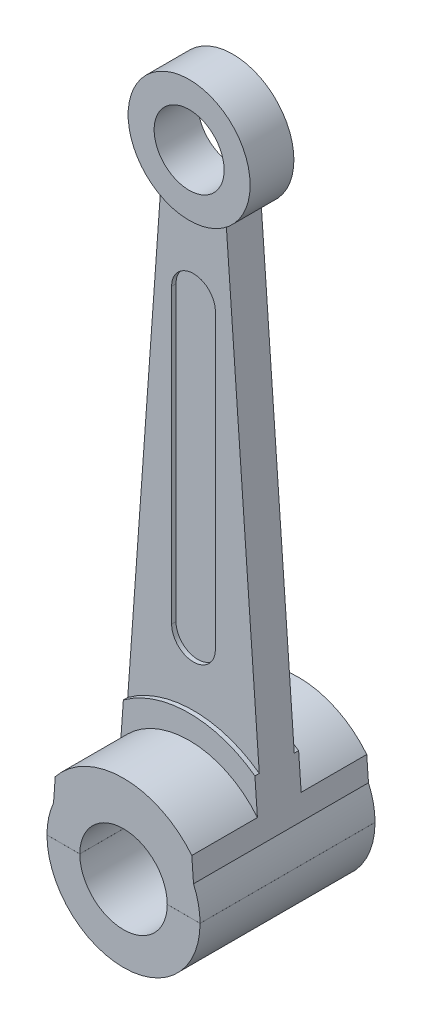
ISO-10303-21;
HEADER;
FILE_DESCRIPTION(('STEP AP214'),'2;1');
FILE_NAME('part.step','',(''),(''),'','','');
FILE_SCHEMA(('AUTOMOTIVE_DESIGN { 1 0 10303 214 1 1 1 1 }'));
ENDSEC;
DATA;
#1=APPLICATION_CONTEXT('core data for automotive mechanical design processes');
#2=APPLICATION_PROTOCOL_DEFINITION('international standard','automotive_design',2000,#1);
#3=PRODUCT_CONTEXT('',#1,'mechanical');
#4=PRODUCT('Part','Part','',(#3));
#5=PRODUCT_RELATED_PRODUCT_CATEGORY('part','',(#4));
#6=PRODUCT_DEFINITION_FORMATION('','',#4);
#7=PRODUCT_DEFINITION_CONTEXT('part definition',#1,'design');
#8=PRODUCT_DEFINITION('design','',#6,#7);
#9=PRODUCT_DEFINITION_SHAPE('','',#8);
#10=(LENGTH_UNIT() NAMED_UNIT(*) SI_UNIT(.MILLI.,.METRE.));
#11=(NAMED_UNIT(*) PLANE_ANGLE_UNIT() SI_UNIT($,.RADIAN.));
#12=(NAMED_UNIT(*) SI_UNIT($,.STERADIAN.) SOLID_ANGLE_UNIT());
#13=UNCERTAINTY_MEASURE_WITH_UNIT(LENGTH_MEASURE(1.E-05),#10,'distance_accuracy_value','');
#14=(GEOMETRIC_REPRESENTATION_CONTEXT(3) GLOBAL_UNCERTAINTY_ASSIGNED_CONTEXT((#13)) GLOBAL_UNIT_ASSIGNED_CONTEXT((#10,
#11,#12)) REPRESENTATION_CONTEXT('',''));
#15=CARTESIAN_POINT('',(0.,0.,0.));
#16=DIRECTION('',(0.,0.,1.));
#17=DIRECTION('',(1.,0.,0.));
#18=AXIS2_PLACEMENT_3D('',#15,#16,#17);
#19=CARTESIAN_POINT('',(0.,0.,-20.75));
#20=DIRECTION('',(0.,0.,1.));
#21=DIRECTION('',(1.,0.,0.));
#22=AXIS2_PLACEMENT_3D('',#19,#20,#21);
#23=CYLINDRICAL_SURFACE('',#22,1.75);
#24=CARTESIAN_POINT('',(0.,0.,-2.));
#25=DIRECTION('',(0.,0.,1.));
#26=DIRECTION('',(1.,0.,0.));
#27=AXIS2_PLACEMENT_3D('',#24,#25,#26);
#28=CIRCLE('',#27,1.75);
#29=CARTESIAN_POINT('',(-1.74999971428569,0.000999999999999505,-2.));
#30=VERTEX_POINT('',#29);
#31=CARTESIAN_POINT('',(-1.6,0.708872343937891,-2.));
#32=VERTEX_POINT('',#31);
#33=EDGE_CURVE('E262',#30,#32,#28,.F.);
#34=ORIENTED_EDGE('',*,*,#33,.F.);
#35=DIRECTION('',(0.,0.,1.));
#36=VECTOR('',#35,1.);
#37=CARTESIAN_POINT('',(-1.74999971428569,0.000999999999999505,-20.75));
#38=LINE('',#37,#36);
#39=CARTESIAN_POINT('',(-1.74999971428569,0.000999999999999505,2.));
#40=VERTEX_POINT('',#39);
#41=EDGE_CURVE('E327',#30,#40,#38,.T.);
#42=ORIENTED_EDGE('',*,*,#41,.T.);
#43=CARTESIAN_POINT('',(0.,0.,2.));
#44=DIRECTION('',(0.,0.,1.));
#45=DIRECTION('',(1.,0.,0.));
#46=AXIS2_PLACEMENT_3D('',#43,#44,#45);
#47=CIRCLE('',#46,1.75);
#48=CARTESIAN_POINT('',(-1.6,0.708872343937891,2.));
#49=VERTEX_POINT('',#48);
#50=EDGE_CURVE('E201',#40,#49,#47,.F.);
#51=ORIENTED_EDGE('',*,*,#50,.T.);
#52=DIRECTION('',(0.,0.,1.));
#53=VECTOR('',#52,1.);
#54=CARTESIAN_POINT('',(-1.6,0.708872343937891,-20.75));
#55=LINE('',#54,#53);
#56=EDGE_CURVE('E257',#32,#49,#55,.T.);
#57=ORIENTED_EDGE('',*,*,#56,.F.);
#58=EDGE_LOOP('',(#34,#42,#51,#57));
#59=FACE_BOUND('',#58,.T.);
#60=ADVANCED_FACE('F59',(#59),#23,.T.);
#61=CARTESIAN_POINT('',(0.,0.,0.5));
#62=DIRECTION('',(0.,0.,-1.));
#63=DIRECTION('',(-1.,0.,0.));
#64=AXIS2_PLACEMENT_3D('',#61,#62,#63);
#65=CYLINDRICAL_SURFACE('',#64,2.54);
#66=CARTESIAN_POINT('',(0.,0.,-0.5));
#67=DIRECTION('',(0.,0.,1.));
#68=DIRECTION('',(1.,0.,0.));
#69=AXIS2_PLACEMENT_3D('',#66,#67,#68);
#70=CIRCLE('',#69,2.54);
#71=CARTESIAN_POINT('',(1.5036414370813,2.04711075144753,-0.5));
#72=VERTEX_POINT('',#71);
#73=CARTESIAN_POINT('',(-1.5036414370813,2.04711075144753,-0.5));
#74=VERTEX_POINT('',#73);
#75=EDGE_CURVE('E197',#72,#74,#70,.T.);
#76=ORIENTED_EDGE('',*,*,#75,.T.);
#77=DIRECTION('',(0.,0.,-1.));
#78=VECTOR('',#77,1.);
#79=CARTESIAN_POINT('',(-1.5036414370813,2.04711075144753,0.5));
#80=LINE('',#79,#78);
#81=CARTESIAN_POINT('',(-1.5036414370813,2.04711075144753,-0.4));
#82=VERTEX_POINT('',#81);
#83=EDGE_CURVE('E200',#74,#82,#80,.F.);
#84=ORIENTED_EDGE('',*,*,#83,.T.);
#85=CARTESIAN_POINT('',(0.,0.,-0.4));
#86=DIRECTION('',(0.,0.,1.));
#87=DIRECTION('',(1.,0.,0.));
#88=AXIS2_PLACEMENT_3D('',#85,#86,#87);
#89=CIRCLE('',#88,2.54);
#90=CARTESIAN_POINT('',(1.5036414370813,2.04711075144753,-0.4));
#91=VERTEX_POINT('',#90);
#92=EDGE_CURVE('E250',#91,#82,#89,.T.);
#93=ORIENTED_EDGE('',*,*,#92,.F.);
#94=DIRECTION('',(0.,0.,-1.));
#95=VECTOR('',#94,1.);
#96=CARTESIAN_POINT('',(1.5036414370813,2.04711075144753,0.5));
#97=LINE('',#96,#95);
#98=EDGE_CURVE('E113',#91,#72,#97,.T.);
#99=ORIENTED_EDGE('',*,*,#98,.T.);
#100=EDGE_LOOP('',(#76,#84,#93,#99));
#101=FACE_BOUND('',#100,.T.);
#102=ADVANCED_FACE('F444',(#101),#65,.T.);
#103=CARTESIAN_POINT('',(0.,10.69,0.4));
#104=DIRECTION('',(0.,0.,-1.));
#105=DIRECTION('',(-1.,0.,0.));
#106=AXIS2_PLACEMENT_3D('',#103,#104,#105);
#107=CYLINDRICAL_SURFACE('',#106,0.5);
#108=DIRECTION('',(0.,0.,-1.));
#109=VECTOR('',#108,1.);
#110=CARTESIAN_POINT('',(0.5,10.69,0.4));
#111=LINE('',#110,#109);
#112=CARTESIAN_POINT('',(0.5,10.69,-0.3));
#113=VERTEX_POINT('',#112);
#114=CARTESIAN_POINT('',(0.5,10.69,-0.4));
#115=VERTEX_POINT('',#114);
#116=EDGE_CURVE('E219',#113,#115,#111,.T.);
#117=ORIENTED_EDGE('',*,*,#116,.F.);
#118=CARTESIAN_POINT('',(0.,10.69,-0.3));
#119=DIRECTION('',(0.,0.,1.));
#120=DIRECTION('',(1.,0.,0.));
#121=AXIS2_PLACEMENT_3D('',#118,#119,#120);
#122=CIRCLE('',#121,0.5);
#123=CARTESIAN_POINT('',(-0.500000000000001,10.69,-0.3));
#124=VERTEX_POINT('',#123);
#125=EDGE_CURVE('E212',#113,#124,#122,.T.);
#126=ORIENTED_EDGE('',*,*,#125,.T.);
#127=DIRECTION('',(0.,0.,-1.));
#128=VECTOR('',#127,1.);
#129=CARTESIAN_POINT('',(-0.500000000000001,10.69,0.4));
#130=LINE('',#129,#128);
#131=CARTESIAN_POINT('',(-0.500000000000001,10.69,-0.4));
#132=VERTEX_POINT('',#131);
#133=EDGE_CURVE('E215',#124,#132,#130,.T.);
#134=ORIENTED_EDGE('',*,*,#133,.T.);
#135=CARTESIAN_POINT('',(0.,10.69,-0.4));
#136=DIRECTION('',(0.,0.,1.));
#137=DIRECTION('',(1.,0.,0.));
#138=AXIS2_PLACEMENT_3D('',#135,#136,#137);
#139=CIRCLE('',#138,0.5);
#140=EDGE_CURVE('E182',#115,#132,#139,.T.);
#141=ORIENTED_EDGE('',*,*,#140,.F.);
#142=EDGE_LOOP('',(#117,#126,#134,#141));
#143=FACE_BOUND('',#142,.T.);
#144=ADVANCED_FACE('F390',(#143),#107,.F.);
#145=CARTESIAN_POINT('',(0.500000000000003,0.,0.4));
#146=DIRECTION('',(-1.,0.,0.));
#147=DIRECTION('',(0.,-1.,0.));
#148=AXIS2_PLACEMENT_3D('',#145,#146,#147);
#149=PLANE('',#148);
#150=DIRECTION('',(0.,0.,-1.));
#151=VECTOR('',#150,1.);
#152=CARTESIAN_POINT('',(0.500000000000001,4.,0.4));
#153=LINE('',#152,#151);
#154=CARTESIAN_POINT('',(0.500000000000001,4.,-0.3));
#155=VERTEX_POINT('',#154);
#156=CARTESIAN_POINT('',(0.500000000000001,4.,-0.4));
#157=VERTEX_POINT('',#156);
#158=EDGE_CURVE('E223',#155,#157,#153,.T.);
#159=ORIENTED_EDGE('',*,*,#158,.F.);
#160=DIRECTION('',(0.,1.,0.));
#161=VECTOR('',#160,1.);
#162=CARTESIAN_POINT('',(0.500000000000001,4.,-0.3));
#163=LINE('',#162,#161);
#164=EDGE_CURVE('E216',#155,#113,#163,.T.);
#165=ORIENTED_EDGE('',*,*,#164,.T.);
#166=ORIENTED_EDGE('',*,*,#116,.T.);
#167=DIRECTION('',(0.,1.,0.));
#168=VECTOR('',#167,1.);
#169=CARTESIAN_POINT('',(0.500000000000003,0.,-0.4));
#170=LINE('',#169,#168);
#171=EDGE_CURVE('E367',#157,#115,#170,.T.);
#172=ORIENTED_EDGE('',*,*,#171,.F.);
#173=EDGE_LOOP('',(#159,#165,#166,#172));
#174=FACE_BOUND('',#173,.T.);
#175=ADVANCED_FACE('F514',(#174),#149,.T.);
#176=CARTESIAN_POINT('',(0.,4.,0.4));
#177=DIRECTION('',(0.,0.,-1.));
#178=DIRECTION('',(-1.,0.,0.));
#179=AXIS2_PLACEMENT_3D('',#176,#177,#178);
#180=CYLINDRICAL_SURFACE('',#179,0.5);
#181=DIRECTION('',(0.,0.,-1.));
#182=VECTOR('',#181,1.);
#183=CARTESIAN_POINT('',(-0.499999999999999,4.,0.4));
#184=LINE('',#183,#182);
#185=CARTESIAN_POINT('',(-0.499999999999999,4.,-0.3));
#186=VERTEX_POINT('',#185);
#187=CARTESIAN_POINT('',(-0.499999999999999,4.,-0.4));
#188=VERTEX_POINT('',#187);
#189=EDGE_CURVE('E361',#186,#188,#184,.T.);
#190=ORIENTED_EDGE('',*,*,#189,.F.);
#191=CARTESIAN_POINT('',(0.,4.,-0.3));
#192=DIRECTION('',(0.,0.,1.));
#193=DIRECTION('',(1.,0.,0.));
#194=AXIS2_PLACEMENT_3D('',#191,#192,#193);
#195=CIRCLE('',#194,0.5);
#196=EDGE_CURVE('E220',#186,#155,#195,.T.);
#197=ORIENTED_EDGE('',*,*,#196,.T.);
#198=ORIENTED_EDGE('',*,*,#158,.T.);
#199=CARTESIAN_POINT('',(0.,4.,-0.4));
#200=DIRECTION('',(0.,0.,1.));
#201=DIRECTION('',(1.,0.,0.));
#202=AXIS2_PLACEMENT_3D('',#199,#200,#201);
#203=CIRCLE('',#202,0.5);
#204=EDGE_CURVE('E371',#188,#157,#203,.T.);
#205=ORIENTED_EDGE('',*,*,#204,.F.);
#206=EDGE_LOOP('',(#190,#197,#198,#205));
#207=FACE_BOUND('',#206,.T.);
#208=ADVANCED_FACE('F512',(#207),#180,.F.);
#209=CARTESIAN_POINT('',(-0.499999999999998,0.,0.4));
#210=DIRECTION('',(-1.,0.,0.));
#211=DIRECTION('',(0.,-1.,0.));
#212=AXIS2_PLACEMENT_3D('',#209,#210,#211);
#213=PLANE('',#212);
#214=DIRECTION('',(0.,1.,0.));
#215=VECTOR('',#214,1.);
#216=CARTESIAN_POINT('',(-0.499999999999999,4.,-0.3));
#217=LINE('',#216,#215);
#218=EDGE_CURVE('E207',#186,#124,#217,.T.);
#219=ORIENTED_EDGE('',*,*,#218,.F.);
#220=ORIENTED_EDGE('',*,*,#189,.T.);
#221=DIRECTION('',(0.,1.,0.));
#222=VECTOR('',#221,1.);
#223=CARTESIAN_POINT('',(-0.499999999999998,0.,-0.4));
#224=LINE('',#223,#222);
#225=EDGE_CURVE('E174',#188,#132,#224,.T.);
#226=ORIENTED_EDGE('',*,*,#225,.T.);
#227=ORIENTED_EDGE('',*,*,#133,.F.);
#228=EDGE_LOOP('',(#219,#220,#226,#227));
#229=FACE_BOUND('',#228,.T.);
#230=ADVANCED_FACE('F507',(#229),#213,.F.);
#231=CARTESIAN_POINT('',(0.,13.69,0.5));
#232=DIRECTION('',(0.,0.,-1.));
#233=DIRECTION('',(-1.,0.,0.));
#234=AXIS2_PLACEMENT_3D('',#231,#232,#233);
#235=CYLINDRICAL_SURFACE('',#234,0.8);
#236=CARTESIAN_POINT('',(0.,13.69,0.5));
#237=DIRECTION('',(0.,0.,1.));
#238=DIRECTION('',(1.,0.,0.));
#239=AXIS2_PLACEMENT_3D('',#236,#237,#238);
#240=CIRCLE('',#239,0.8);
#241=CARTESIAN_POINT('',(0.799999999999999,13.69,0.5));
#242=VERTEX_POINT('',#241);
#243=EDGE_CURVE('E171',#242,#242,#240,.T.);
#244=ORIENTED_EDGE('',*,*,#243,.T.);
#245=EDGE_LOOP('',(#244));
#246=FACE_BOUND('',#245,.T.);
#247=CARTESIAN_POINT('',(0.,13.69,-0.5));
#248=DIRECTION('',(0.,0.,1.));
#249=DIRECTION('',(1.,0.,0.));
#250=AXIS2_PLACEMENT_3D('',#247,#248,#249);
#251=CIRCLE('',#250,0.8);
#252=CARTESIAN_POINT('',(0.799999999999999,13.69,-0.5));
#253=VERTEX_POINT('',#252);
#254=EDGE_CURVE('E196',#253,#253,#251,.T.);
#255=ORIENTED_EDGE('',*,*,#254,.F.);
#256=EDGE_LOOP('',(#255));
#257=FACE_BOUND('',#256,.T.);
#258=ADVANCED_FACE('F553',(#246,#257),#235,.F.);
#259=CARTESIAN_POINT('',(0.,13.69,0.5));
#260=DIRECTION('',(0.,0.,-1.));
#261=DIRECTION('',(-1.,0.,0.));
#262=AXIS2_PLACEMENT_3D('',#259,#260,#261);
#263=CYLINDRICAL_SURFACE('',#262,1.395);
#264=DIRECTION('',(0.,0.,-1.));
#265=VECTOR('',#264,1.);
#266=CARTESIAN_POINT('',(-0.75,12.5137666047931,0.4));
#267=LINE('',#266,#265);
#268=CARTESIAN_POINT('',(-0.75,12.5137666047931,0.400000000000001));
#269=VERTEX_POINT('',#268);
#270=CARTESIAN_POINT('',(-0.75,12.5137666047931,-0.400000000000001));
#271=VERTEX_POINT('',#270);
#272=EDGE_CURVE('E170',#269,#271,#267,.T.);
#273=ORIENTED_EDGE('',*,*,#272,.F.);
#274=CARTESIAN_POINT('',(0.,13.69,0.4));
#275=DIRECTION('',(0.,0.,1.));
#276=DIRECTION('',(1.,0.,0.));
#277=AXIS2_PLACEMENT_3D('',#274,#275,#276);
#278=CIRCLE('',#277,1.395);
#279=CARTESIAN_POINT('',(0.75,12.5137666047931,0.400000000000001));
#280=VERTEX_POINT('',#279);
#281=EDGE_CURVE('E152',#269,#280,#278,.T.);
#282=ORIENTED_EDGE('',*,*,#281,.T.);
#283=DIRECTION('',(0.,0.,-1.));
#284=VECTOR('',#283,1.);
#285=CARTESIAN_POINT('',(0.75,12.5137666047931,0.4));
#286=LINE('',#285,#284);
#287=CARTESIAN_POINT('',(0.75,12.5137666047931,-0.400000000000001));
#288=VERTEX_POINT('',#287);
#289=EDGE_CURVE('E142',#280,#288,#286,.T.);
#290=ORIENTED_EDGE('',*,*,#289,.T.);
#291=CARTESIAN_POINT('',(0.,13.69,-0.4));
#292=DIRECTION('',(0.,0.,1.));
#293=DIRECTION('',(1.,0.,0.));
#294=AXIS2_PLACEMENT_3D('',#291,#292,#293);
#295=CIRCLE('',#294,1.395);
#296=EDGE_CURVE('E249',#271,#288,#295,.T.);
#297=ORIENTED_EDGE('',*,*,#296,.F.);
#298=EDGE_LOOP('',(#273,#282,#290,#297));
#299=FACE_BOUND('',#298,.T.);
#300=CARTESIAN_POINT('',(0.,13.69,-0.5));
#301=DIRECTION('',(0.,0.,1.));
#302=DIRECTION('',(1.,0.,0.));
#303=AXIS2_PLACEMENT_3D('',#300,#301,#302);
#304=CIRCLE('',#303,1.395);
#305=CARTESIAN_POINT('',(1.395,13.69,-0.5));
#306=VERTEX_POINT('',#305);
#307=EDGE_CURVE('E151',#306,#306,#304,.T.);
#308=ORIENTED_EDGE('',*,*,#307,.T.);
#309=EDGE_LOOP('',(#308));
#310=FACE_BOUND('',#309,.T.);
#311=CARTESIAN_POINT('',(0.,13.69,0.5));
#312=DIRECTION('',(0.,0.,1.));
#313=DIRECTION('',(1.,0.,0.));
#314=AXIS2_PLACEMENT_3D('',#311,#312,#313);
#315=CIRCLE('',#314,1.395);
#316=CARTESIAN_POINT('',(1.395,13.69,0.5));
#317=VERTEX_POINT('',#316);
#318=EDGE_CURVE('E350',#317,#317,#315,.T.);
#319=ORIENTED_EDGE('',*,*,#318,.F.);
#320=EDGE_LOOP('',(#319));
#321=FACE_BOUND('',#320,.T.);
#322=ADVANCED_FACE('F167',(#299,#310,#321),#263,.T.);
#323=CARTESIAN_POINT('',(0.,0.,0.5));
#324=DIRECTION('',(0.,0.,1.));
#325=DIRECTION('',(1.,0.,0.));
#326=AXIS2_PLACEMENT_3D('',#323,#324,#325);
#327=PLANE('',#326);
#328=ORIENTED_EDGE('',*,*,#243,.F.);
#329=EDGE_LOOP('',(#328));
#330=FACE_BOUND('',#329,.T.);
#331=ORIENTED_EDGE('',*,*,#318,.T.);
#332=EDGE_LOOP('',(#331));
#333=FACE_BOUND('',#332,.T.);
#334=ADVANCED_FACE('F562',(#330,#333),#327,.T.);
#335=CARTESIAN_POINT('',(0.,0.,-0.5));
#336=DIRECTION('',(0.,0.,1.));
#337=DIRECTION('',(1.,0.,0.));
#338=AXIS2_PLACEMENT_3D('',#335,#336,#337);
#339=PLANE('',#338);
#340=ORIENTED_EDGE('',*,*,#254,.T.);
#341=EDGE_LOOP('',(#340));
#342=FACE_BOUND('',#341,.T.);
#343=ORIENTED_EDGE('',*,*,#307,.F.);
#344=EDGE_LOOP('',(#343));
#345=FACE_BOUND('',#344,.T.);
#346=ADVANCED_FACE('F534',(#342,#345),#339,.F.);
#347=CARTESIAN_POINT('',(0.,10.69,0.3));
#348=DIRECTION('',(0.,0.,1.));
#349=DIRECTION('',(1.,0.,0.));
#350=AXIS2_PLACEMENT_3D('',#347,#348,#349);
#351=CIRCLE('',#350,0.5);
#352=CARTESIAN_POINT('',(0.5,10.69,0.3));
#353=VERTEX_POINT('',#352);
#354=CARTESIAN_POINT('',(-0.500000000000001,10.69,0.3));
#355=VERTEX_POINT('',#354);
#356=EDGE_CURVE('E227',#353,#355,#351,.T.);
#357=ORIENTED_EDGE('',*,*,#356,.F.);
#358=CARTESIAN_POINT('',(0.5,10.69,0.4));
#359=VERTEX_POINT('',#358);
#360=EDGE_CURVE('E188',#359,#353,#111,.T.);
#361=ORIENTED_EDGE('',*,*,#360,.F.);
#362=CARTESIAN_POINT('',(0.,10.69,0.4));
#363=DIRECTION('',(0.,0.,1.));
#364=DIRECTION('',(1.,0.,0.));
#365=AXIS2_PLACEMENT_3D('',#362,#363,#364);
#366=CIRCLE('',#365,0.5);
#367=CARTESIAN_POINT('',(-0.500000000000001,10.69,0.4));
#368=VERTEX_POINT('',#367);
#369=EDGE_CURVE('E193',#359,#368,#366,.T.);
#370=ORIENTED_EDGE('',*,*,#369,.T.);
#371=EDGE_CURVE('E192',#368,#355,#130,.T.);
#372=ORIENTED_EDGE('',*,*,#371,.T.);
#373=EDGE_LOOP('',(#357,#361,#370,#372));
#374=FACE_BOUND('',#373,.T.);
#375=ADVANCED_FACE('F525',(#374),#107,.F.);
#376=DIRECTION('',(0.,1.,0.));
#377=VECTOR('',#376,1.);
#378=CARTESIAN_POINT('',(0.500000000000001,4.,0.3));
#379=LINE('',#378,#377);
#380=CARTESIAN_POINT('',(0.500000000000001,4.,0.3));
#381=VERTEX_POINT('',#380);
#382=EDGE_CURVE('E231',#381,#353,#379,.T.);
#383=ORIENTED_EDGE('',*,*,#382,.F.);
#384=CARTESIAN_POINT('',(0.500000000000001,4.,0.4));
#385=VERTEX_POINT('',#384);
#386=EDGE_CURVE('E187',#385,#381,#153,.T.);
#387=ORIENTED_EDGE('',*,*,#386,.F.);
#388=DIRECTION('',(0.,1.,0.));
#389=VECTOR('',#388,1.);
#390=CARTESIAN_POINT('',(0.500000000000003,0.,0.4));
#391=LINE('',#390,#389);
#392=EDGE_CURVE('E189',#385,#359,#391,.T.);
#393=ORIENTED_EDGE('',*,*,#392,.T.);
#394=ORIENTED_EDGE('',*,*,#360,.T.);
#395=EDGE_LOOP('',(#383,#387,#393,#394));
#396=FACE_BOUND('',#395,.T.);
#397=ADVANCED_FACE('F517',(#396),#149,.T.);
#398=CARTESIAN_POINT('',(0.,4.,0.3));
#399=DIRECTION('',(0.,0.,1.));
#400=DIRECTION('',(1.,0.,0.));
#401=AXIS2_PLACEMENT_3D('',#398,#399,#400);
#402=CIRCLE('',#401,0.5);
#403=CARTESIAN_POINT('',(-0.499999999999999,4.,0.3));
#404=VERTEX_POINT('',#403);
#405=EDGE_CURVE('E210',#404,#381,#402,.T.);
#406=ORIENTED_EDGE('',*,*,#405,.F.);
#407=CARTESIAN_POINT('',(-0.499999999999999,4.,0.4));
#408=VERTEX_POINT('',#407);
#409=EDGE_CURVE('E226',#408,#404,#184,.T.);
#410=ORIENTED_EDGE('',*,*,#409,.F.);
#411=CARTESIAN_POINT('',(0.,4.,0.4));
#412=DIRECTION('',(0.,0.,1.));
#413=DIRECTION('',(1.,0.,0.));
#414=AXIS2_PLACEMENT_3D('',#411,#412,#413);
#415=CIRCLE('',#414,0.5);
#416=EDGE_CURVE('E184',#408,#385,#415,.T.);
#417=ORIENTED_EDGE('',*,*,#416,.T.);
#418=ORIENTED_EDGE('',*,*,#386,.T.);
#419=EDGE_LOOP('',(#406,#410,#417,#418));
#420=FACE_BOUND('',#419,.T.);
#421=ADVANCED_FACE('F523',(#420),#180,.F.);
#422=ORIENTED_EDGE('',*,*,#409,.T.);
#423=DIRECTION('',(0.,1.,0.));
#424=VECTOR('',#423,1.);
#425=CARTESIAN_POINT('',(-0.499999999999999,4.,0.3));
#426=LINE('',#425,#424);
#427=EDGE_CURVE('E183',#404,#355,#426,.T.);
#428=ORIENTED_EDGE('',*,*,#427,.T.);
#429=ORIENTED_EDGE('',*,*,#371,.F.);
#430=DIRECTION('',(0.,1.,0.));
#431=VECTOR('',#430,1.);
#432=CARTESIAN_POINT('',(-0.499999999999998,0.,0.4));
#433=LINE('',#432,#431);
#434=EDGE_CURVE('E179',#408,#368,#433,.T.);
#435=ORIENTED_EDGE('',*,*,#434,.F.);
#436=EDGE_LOOP('',(#422,#428,#429,#435));
#437=FACE_BOUND('',#436,.T.);
#438=ADVANCED_FACE('F532',(#437),#213,.F.);
#439=CARTESIAN_POINT('',(0.,0.,0.4));
#440=DIRECTION('',(0.,0.,1.));
#441=DIRECTION('',(1.,0.,0.));
#442=AXIS2_PLACEMENT_3D('',#439,#440,#441);
#443=PLANE('',#442);
#444=DIRECTION('',(0.0718181006562887,0.997417746191697,0.));
#445=VECTOR('',#444,1.);
#446=CARTESIAN_POINT('',(-1.64252585982471,0.118268486781843,0.4));
#447=LINE('',#446,#445);
#448=CARTESIAN_POINT('',(-1.5036414370813,2.04711075144753,0.4));
#449=VERTEX_POINT('',#448);
#450=EDGE_CURVE('E263',#449,#269,#447,.T.);
#451=ORIENTED_EDGE('',*,*,#450,.F.);
#452=CARTESIAN_POINT('',(0.,0.,0.4));
#453=DIRECTION('',(0.,0.,1.));
#454=DIRECTION('',(1.,0.,0.));
#455=AXIS2_PLACEMENT_3D('',#452,#453,#454);
#456=CIRCLE('',#455,2.54);
#457=CARTESIAN_POINT('',(1.5036414370813,2.04711075144753,0.4));
#458=VERTEX_POINT('',#457);
#459=EDGE_CURVE('E162',#458,#449,#456,.T.);
#460=ORIENTED_EDGE('',*,*,#459,.F.);
#461=DIRECTION('',(0.0718181006562887,-0.997417746191697,0.));
#462=VECTOR('',#461,1.);
#463=CARTESIAN_POINT('',(1.64252585982471,0.118268486781843,0.4));
#464=LINE('',#463,#462);
#465=EDGE_CURVE('E145',#280,#458,#464,.T.);
#466=ORIENTED_EDGE('',*,*,#465,.F.);
#467=ORIENTED_EDGE('',*,*,#281,.F.);
#468=EDGE_LOOP('',(#451,#460,#466,#467));
#469=FACE_BOUND('',#468,.T.);
#470=ORIENTED_EDGE('',*,*,#369,.F.);
#471=ORIENTED_EDGE('',*,*,#392,.F.);
#472=ORIENTED_EDGE('',*,*,#416,.F.);
#473=ORIENTED_EDGE('',*,*,#434,.T.);
#474=EDGE_LOOP('',(#470,#471,#472,#473));
#475=FACE_BOUND('',#474,.T.);
#476=ADVANCED_FACE('F158',(#469,#475),#443,.T.);
#477=CARTESIAN_POINT('',(0.,0.,-0.4));
#478=DIRECTION('',(0.,0.,1.));
#479=DIRECTION('',(1.,0.,0.));
#480=AXIS2_PLACEMENT_3D('',#477,#478,#479);
#481=PLANE('',#480);
#482=ORIENTED_EDGE('',*,*,#140,.T.);
#483=ORIENTED_EDGE('',*,*,#225,.F.);
#484=ORIENTED_EDGE('',*,*,#204,.T.);
#485=ORIENTED_EDGE('',*,*,#171,.T.);
#486=EDGE_LOOP('',(#482,#483,#484,#485));
#487=FACE_BOUND('',#486,.T.);
#488=ORIENTED_EDGE('',*,*,#92,.T.);
#489=DIRECTION('',(0.0718181006562887,0.997417746191697,0.));
#490=VECTOR('',#489,1.);
#491=CARTESIAN_POINT('',(-1.64252585982471,0.118268486781843,-0.4));
#492=LINE('',#491,#490);
#493=EDGE_CURVE('E246',#82,#271,#492,.T.);
#494=ORIENTED_EDGE('',*,*,#493,.T.);
#495=ORIENTED_EDGE('',*,*,#296,.T.);
#496=DIRECTION('',(0.0718181006562887,-0.997417746191697,0.));
#497=VECTOR('',#496,1.);
#498=CARTESIAN_POINT('',(1.64252585982471,0.118268486781843,-0.4));
#499=LINE('',#498,#497);
#500=EDGE_CURVE('E107',#288,#91,#499,.T.);
#501=ORIENTED_EDGE('',*,*,#500,.T.);
#502=EDGE_LOOP('',(#488,#494,#495,#501));
#503=FACE_BOUND('',#502,.T.);
#504=ADVANCED_FACE('F379',(#487,#503),#481,.F.);
#505=ORIENTED_EDGE('',*,*,#459,.T.);
#506=CARTESIAN_POINT('',(-1.5036414370813,2.04711075144753,0.5));
#507=VERTEX_POINT('',#506);
#508=EDGE_CURVE('E267',#449,#507,#80,.F.);
#509=ORIENTED_EDGE('',*,*,#508,.T.);
#510=CARTESIAN_POINT('',(0.,0.,0.5));
#511=DIRECTION('',(0.,0.,1.));
#512=DIRECTION('',(1.,0.,0.));
#513=AXIS2_PLACEMENT_3D('',#510,#511,#512);
#514=CIRCLE('',#513,2.54);
#515=CARTESIAN_POINT('',(1.5036414370813,2.04711075144753,0.5));
#516=VERTEX_POINT('',#515);
#517=EDGE_CURVE('E202',#516,#507,#514,.T.);
#518=ORIENTED_EDGE('',*,*,#517,.F.);
#519=EDGE_CURVE('E206',#516,#458,#97,.T.);
#520=ORIENTED_EDGE('',*,*,#519,.T.);
#521=EDGE_LOOP('',(#505,#509,#518,#520));
#522=FACE_BOUND('',#521,.T.);
#523=ADVANCED_FACE('F465',(#522),#65,.T.);
#524=CARTESIAN_POINT('',(0.,0.,0.5));
#525=DIRECTION('',(0.,0.,1.));
#526=DIRECTION('',(1.,0.,0.));
#527=AXIS2_PLACEMENT_3D('',#524,#525,#526);
#528=PLANE('',#527);
#529=DIRECTION('',(0.0718181006562887,0.997417746191697,0.));
#530=VECTOR('',#529,1.);
#531=CARTESIAN_POINT('',(-1.64252585982471,0.118268486781843,0.5));
#532=LINE('',#531,#530);
#533=CARTESIAN_POINT('',(-1.56101559444764,1.25029209142955,0.5));
#534=VERTEX_POINT('',#533);
#535=EDGE_CURVE('E266',#534,#507,#532,.T.);
#536=ORIENTED_EDGE('',*,*,#535,.F.);
#537=CARTESIAN_POINT('',(0.,0.,0.5));
#538=DIRECTION('',(0.,0.,1.));
#539=DIRECTION('',(1.,0.,0.));
#540=AXIS2_PLACEMENT_3D('',#537,#538,#539);
#541=CIRCLE('',#540,2.);
#542=CARTESIAN_POINT('',(1.56101559444764,1.25029209142955,0.5));
#543=VERTEX_POINT('',#542);
#544=EDGE_CURVE('E236',#543,#534,#541,.T.);
#545=ORIENTED_EDGE('',*,*,#544,.F.);
#546=DIRECTION('',(0.0718181006562887,-0.997417746191697,0.));
#547=VECTOR('',#546,1.);
#548=CARTESIAN_POINT('',(1.64252585982471,0.118268486781843,0.5));
#549=LINE('',#548,#547);
#550=EDGE_CURVE('E163',#516,#543,#549,.T.);
#551=ORIENTED_EDGE('',*,*,#550,.F.);
#552=ORIENTED_EDGE('',*,*,#517,.T.);
#553=EDGE_LOOP('',(#536,#545,#551,#552));
#554=FACE_BOUND('',#553,.T.);
#555=ADVANCED_FACE('F461',(#554),#528,.T.);
#556=CARTESIAN_POINT('',(0.,0.,-0.5));
#557=DIRECTION('',(0.,0.,1.));
#558=DIRECTION('',(1.,0.,0.));
#559=AXIS2_PLACEMENT_3D('',#556,#557,#558);
#560=PLANE('',#559);
#561=CARTESIAN_POINT('',(0.,0.,-0.5));
#562=DIRECTION('',(0.,0.,1.));
#563=DIRECTION('',(1.,0.,0.));
#564=AXIS2_PLACEMENT_3D('',#561,#562,#563);
#565=CIRCLE('',#564,2.);
#566=CARTESIAN_POINT('',(1.56101559444764,1.25029209142955,-0.5));
#567=VERTEX_POINT('',#566);
#568=CARTESIAN_POINT('',(-1.56101559444764,1.25029209142955,-0.5));
#569=VERTEX_POINT('',#568);
#570=EDGE_CURVE('E205',#567,#569,#565,.T.);
#571=ORIENTED_EDGE('',*,*,#570,.T.);
#572=DIRECTION('',(0.0718181006562887,0.997417746191697,0.));
#573=VECTOR('',#572,1.);
#574=CARTESIAN_POINT('',(-1.64252585982471,0.118268486781843,-0.5));
#575=LINE('',#574,#573);
#576=EDGE_CURVE('E251',#569,#74,#575,.T.);
#577=ORIENTED_EDGE('',*,*,#576,.T.);
#578=ORIENTED_EDGE('',*,*,#75,.F.);
#579=DIRECTION('',(0.0718181006562887,-0.997417746191697,0.));
#580=VECTOR('',#579,1.);
#581=CARTESIAN_POINT('',(1.64252585982471,0.118268486781843,-0.5));
#582=LINE('',#581,#580);
#583=EDGE_CURVE('E211',#72,#567,#582,.T.);
#584=ORIENTED_EDGE('',*,*,#583,.T.);
#585=EDGE_LOOP('',(#571,#577,#578,#584));
#586=FACE_BOUND('',#585,.T.);
#587=ADVANCED_FACE('F448',(#586),#560,.F.);
#588=CARTESIAN_POINT('',(0.,4.,-0.3));
#589=DIRECTION('',(0.,0.,1.));
#590=DIRECTION('',(1.,0.,0.));
#591=AXIS2_PLACEMENT_3D('',#588,#589,#590);
#592=PLANE('',#591);
#593=ORIENTED_EDGE('',*,*,#196,.F.);
#594=ORIENTED_EDGE('',*,*,#218,.T.);
#595=ORIENTED_EDGE('',*,*,#125,.F.);
#596=ORIENTED_EDGE('',*,*,#164,.F.);
#597=EDGE_LOOP('',(#593,#594,#595,#596));
#598=FACE_BOUND('',#597,.T.);
#599=ADVANCED_FACE('F638',(#598),#592,.F.);
#600=CARTESIAN_POINT('',(0.,4.,0.3));
#601=DIRECTION('',(0.,0.,1.));
#602=DIRECTION('',(1.,0.,0.));
#603=AXIS2_PLACEMENT_3D('',#600,#601,#602);
#604=PLANE('',#603);
#605=ORIENTED_EDGE('',*,*,#405,.T.);
#606=ORIENTED_EDGE('',*,*,#382,.T.);
#607=ORIENTED_EDGE('',*,*,#356,.T.);
#608=ORIENTED_EDGE('',*,*,#427,.F.);
#609=EDGE_LOOP('',(#605,#606,#607,#608));
#610=FACE_BOUND('',#609,.T.);
#611=ADVANCED_FACE('F545',(#610),#604,.T.);
#612=CARTESIAN_POINT('',(0.,0.,-2.));
#613=DIRECTION('',(0.,0.,1.));
#614=DIRECTION('',(1.,0.,0.));
#615=AXIS2_PLACEMENT_3D('',#612,#613,#614);
#616=CYLINDRICAL_SURFACE('',#615,2.);
#617=DIRECTION('',(0.,0.,1.));
#618=VECTOR('',#617,1.);
#619=CARTESIAN_POINT('',(-1.56101559444764,1.25029209142955,-2.));
#620=LINE('',#619,#618);
#621=CARTESIAN_POINT('',(-1.56101559444764,1.25029209142955,-2.));
#622=VERTEX_POINT('',#621);
#623=EDGE_CURVE('E254',#569,#622,#620,.F.);
#624=ORIENTED_EDGE('',*,*,#623,.F.);
#625=ORIENTED_EDGE('',*,*,#570,.F.);
#626=DIRECTION('',(0.,0.,1.));
#627=VECTOR('',#626,1.);
#628=CARTESIAN_POINT('',(1.56101559444764,1.25029209142955,-2.));
#629=LINE('',#628,#627);
#630=CARTESIAN_POINT('',(1.56101559444764,1.25029209142955,-2.));
#631=VERTEX_POINT('',#630);
#632=EDGE_CURVE('E279',#631,#567,#629,.T.);
#633=ORIENTED_EDGE('',*,*,#632,.F.);
#634=CARTESIAN_POINT('',(0.,0.,-2.));
#635=DIRECTION('',(0.,0.,1.));
#636=DIRECTION('',(1.,0.,0.));
#637=AXIS2_PLACEMENT_3D('',#634,#635,#636);
#638=CIRCLE('',#637,2.);
#639=EDGE_CURVE('E230',#631,#622,#638,.T.);
#640=ORIENTED_EDGE('',*,*,#639,.T.);
#641=EDGE_LOOP('',(#624,#625,#633,#640));
#642=FACE_BOUND('',#641,.T.);
#643=ADVANCED_FACE('F452',(#642),#616,.T.);
#644=CARTESIAN_POINT('',(0.,0.,-2.));
#645=DIRECTION('',(0.,0.,1.));
#646=DIRECTION('',(1.,0.,0.));
#647=AXIS2_PLACEMENT_3D('',#644,#645,#646);
#648=PLANE('',#647);
#649=CARTESIAN_POINT('',(1.6,0.708872343937891,-2.));
#650=VERTEX_POINT('',#649);
#651=CARTESIAN_POINT('',(1.74999971428569,0.000999999999999924,-2.));
#652=VERTEX_POINT('',#651);
#653=EDGE_CURVE('E63',#650,#652,#28,.F.);
#654=ORIENTED_EDGE('',*,*,#653,.T.);
#655=DIRECTION('',(-1.,0.,0.));
#656=VECTOR('',#655,1.);
#657=CARTESIAN_POINT('',(0.,0.000999999999999714,-2.));
#658=LINE('',#657,#656);
#659=CARTESIAN_POINT('',(0.999999499999875,0.000999999999999834,-2.));
#660=VERTEX_POINT('',#659);
#661=EDGE_CURVE('E295',#652,#660,#658,.T.);
#662=ORIENTED_EDGE('',*,*,#661,.T.);
#663=CARTESIAN_POINT('',(0.,0.,-2.));
#664=DIRECTION('',(0.,0.,1.));
#665=DIRECTION('',(1.,0.,0.));
#666=AXIS2_PLACEMENT_3D('',#663,#664,#665);
#667=CIRCLE('',#666,1.);
#668=CARTESIAN_POINT('',(-0.999999499999875,0.000999999999999595,-2.));
#669=VERTEX_POINT('',#668);
#670=EDGE_CURVE('E240',#669,#660,#667,.F.);
#671=ORIENTED_EDGE('',*,*,#670,.F.);
#672=EDGE_CURVE('E79',#669,#30,#658,.T.);
#673=ORIENTED_EDGE('',*,*,#672,.T.);
#674=ORIENTED_EDGE('',*,*,#33,.T.);
#675=DIRECTION('',(0.0718181006562887,0.997417746191697,0.));
#676=VECTOR('',#675,1.);
#677=CARTESIAN_POINT('',(-1.64252585982471,0.118268486781843,-2.));
#678=LINE('',#677,#676);
#679=EDGE_CURVE('E258',#32,#622,#678,.T.);
#680=ORIENTED_EDGE('',*,*,#679,.T.);
#681=ORIENTED_EDGE('',*,*,#639,.F.);
#682=DIRECTION('',(0.0718181006562887,-0.997417746191697,0.));
#683=VECTOR('',#682,1.);
#684=CARTESIAN_POINT('',(1.64252585982471,0.118268486781843,-2.));
#685=LINE('',#684,#683);
#686=EDGE_CURVE('E261',#631,#650,#685,.T.);
#687=ORIENTED_EDGE('',*,*,#686,.T.);
#688=EDGE_LOOP('',(#654,#662,#671,#673,#674,#680,#681,#687));
#689=FACE_BOUND('',#688,.T.);
#690=ADVANCED_FACE('F61',(#689),#648,.F.);
#691=CARTESIAN_POINT('',(0.,0.,0.5));
#692=DIRECTION('',(0.,0.,-1.));
#693=DIRECTION('',(-1.,0.,0.));
#694=AXIS2_PLACEMENT_3D('',#691,#692,#693);
#695=CYLINDRICAL_SURFACE('',#694,1.);
#696=DIRECTION('',(0.,0.,-1.));
#697=VECTOR('',#696,1.);
#698=CARTESIAN_POINT('',(0.999999499999875,0.000999999999999834,0.5));
#699=LINE('',#698,#697);
#700=CARTESIAN_POINT('',(0.999999499999875,0.000999999999999834,2.));
#701=VERTEX_POINT('',#700);
#702=EDGE_CURVE('E294',#701,#660,#699,.T.);
#703=ORIENTED_EDGE('',*,*,#702,.F.);
#704=CARTESIAN_POINT('',(0.,0.,2.));
#705=DIRECTION('',(0.,0.,1.));
#706=DIRECTION('',(1.,0.,0.));
#707=AXIS2_PLACEMENT_3D('',#704,#705,#706);
#708=CIRCLE('',#707,1.);
#709=CARTESIAN_POINT('',(-0.999999499999875,0.000999999999999595,2.));
#710=VERTEX_POINT('',#709);
#711=EDGE_CURVE('E245',#710,#701,#708,.F.);
#712=ORIENTED_EDGE('',*,*,#711,.F.);
#713=DIRECTION('',(0.,0.,-1.));
#714=VECTOR('',#713,1.);
#715=CARTESIAN_POINT('',(-0.999999499999875,0.000999999999999595,0.5));
#716=LINE('',#715,#714);
#717=EDGE_CURVE('E69',#669,#710,#716,.F.);
#718=ORIENTED_EDGE('',*,*,#717,.F.);
#719=ORIENTED_EDGE('',*,*,#670,.T.);
#720=EDGE_LOOP('',(#703,#712,#718,#719));
#721=FACE_BOUND('',#720,.T.);
#722=ADVANCED_FACE('F311',(#721),#695,.F.);
#723=DIRECTION('',(0.,0.,1.));
#724=VECTOR('',#723,1.);
#725=CARTESIAN_POINT('',(-1.56101559444764,1.25029209142955,-2.));
#726=LINE('',#725,#724);
#727=CARTESIAN_POINT('',(-1.56101559444764,1.25029209142955,2.));
#728=VERTEX_POINT('',#727);
#729=EDGE_CURVE('E272',#728,#534,#726,.F.);
#730=ORIENTED_EDGE('',*,*,#729,.F.);
#731=CARTESIAN_POINT('',(0.,0.,2.));
#732=DIRECTION('',(0.,0.,1.));
#733=DIRECTION('',(1.,0.,0.));
#734=AXIS2_PLACEMENT_3D('',#731,#732,#733);
#735=CIRCLE('',#734,2.);
#736=CARTESIAN_POINT('',(1.56101559444764,1.25029209142955,2.));
#737=VERTEX_POINT('',#736);
#738=EDGE_CURVE('E239',#737,#728,#735,.T.);
#739=ORIENTED_EDGE('',*,*,#738,.F.);
#740=DIRECTION('',(0.,0.,1.));
#741=VECTOR('',#740,1.);
#742=CARTESIAN_POINT('',(1.56101559444764,1.25029209142955,-2.));
#743=LINE('',#742,#741);
#744=EDGE_CURVE('E286',#543,#737,#743,.T.);
#745=ORIENTED_EDGE('',*,*,#744,.F.);
#746=ORIENTED_EDGE('',*,*,#544,.T.);
#747=EDGE_LOOP('',(#730,#739,#745,#746));
#748=FACE_BOUND('',#747,.T.);
#749=ADVANCED_FACE('F457',(#748),#616,.T.);
#750=CARTESIAN_POINT('',(0.,0.,2.));
#751=DIRECTION('',(0.,0.,1.));
#752=DIRECTION('',(1.,0.,0.));
#753=AXIS2_PLACEMENT_3D('',#750,#751,#752);
#754=PLANE('',#753);
#755=DIRECTION('',(-1.,0.,0.));
#756=VECTOR('',#755,1.);
#757=CARTESIAN_POINT('',(0.,0.000999999999999714,2.));
#758=LINE('',#757,#756);
#759=CARTESIAN_POINT('',(1.74999971428569,0.000999999999999924,2.));
#760=VERTEX_POINT('',#759);
#761=EDGE_CURVE('E71',#760,#701,#758,.T.);
#762=ORIENTED_EDGE('',*,*,#761,.F.);
#763=CARTESIAN_POINT('',(1.6,0.708872343937891,2.));
#764=VERTEX_POINT('',#763);
#765=EDGE_CURVE('E299',#764,#760,#47,.F.);
#766=ORIENTED_EDGE('',*,*,#765,.F.);
#767=DIRECTION('',(0.0718181006562887,-0.997417746191697,0.));
#768=VECTOR('',#767,1.);
#769=CARTESIAN_POINT('',(1.64252585982471,0.118268486781843,2.));
#770=LINE('',#769,#768);
#771=EDGE_CURVE('E281',#737,#764,#770,.T.);
#772=ORIENTED_EDGE('',*,*,#771,.F.);
#773=ORIENTED_EDGE('',*,*,#738,.T.);
#774=DIRECTION('',(0.0718181006562887,0.997417746191697,0.));
#775=VECTOR('',#774,1.);
#776=CARTESIAN_POINT('',(-1.64252585982471,0.118268486781843,2.));
#777=LINE('',#776,#775);
#778=EDGE_CURVE('E275',#49,#728,#777,.T.);
#779=ORIENTED_EDGE('',*,*,#778,.F.);
#780=ORIENTED_EDGE('',*,*,#50,.F.);
#781=EDGE_CURVE('E13',#710,#40,#758,.T.);
#782=ORIENTED_EDGE('',*,*,#781,.F.);
#783=ORIENTED_EDGE('',*,*,#711,.T.);
#784=EDGE_LOOP('',(#762,#766,#772,#773,#779,#780,#782,#783));
#785=FACE_BOUND('',#784,.T.);
#786=ADVANCED_FACE('F307',(#785),#754,.T.);
#787=CARTESIAN_POINT('',(-0.75,12.5137666047931,-20.75));
#788=DIRECTION('',(0.997417746191696,-0.0718181006562887,0.));
#789=DIRECTION('',(0.0718181006562887,0.997417746191697,0.));
#790=AXIS2_PLACEMENT_3D('',#787,#788,#789);
#791=PLANE('',#790);
#792=ORIENTED_EDGE('',*,*,#83,.F.);
#793=ORIENTED_EDGE('',*,*,#576,.F.);
#794=ORIENTED_EDGE('',*,*,#623,.T.);
#795=ORIENTED_EDGE('',*,*,#679,.F.);
#796=ORIENTED_EDGE('',*,*,#56,.T.);
#797=ORIENTED_EDGE('',*,*,#778,.T.);
#798=ORIENTED_EDGE('',*,*,#729,.T.);
#799=ORIENTED_EDGE('',*,*,#535,.T.);
#800=ORIENTED_EDGE('',*,*,#508,.F.);
#801=ORIENTED_EDGE('',*,*,#450,.T.);
#802=ORIENTED_EDGE('',*,*,#272,.T.);
#803=ORIENTED_EDGE('',*,*,#493,.F.);
#804=EDGE_LOOP('',(#792,#793,#794,#795,#796,#797,#798,#799,#800,#801,#802,#803));
#805=FACE_BOUND('',#804,.T.);
#806=ADVANCED_FACE('F335',(#805),#791,.F.);
#807=ORIENTED_EDGE('',*,*,#765,.T.);
#808=DIRECTION('',(0.,0.,1.));
#809=VECTOR('',#808,1.);
#810=CARTESIAN_POINT('',(1.74999971428569,0.000999999999999924,-20.75));
#811=LINE('',#810,#809);
#812=EDGE_CURVE('E100',#760,#652,#811,.F.);
#813=ORIENTED_EDGE('',*,*,#812,.T.);
#814=ORIENTED_EDGE('',*,*,#653,.F.);
#815=DIRECTION('',(0.,0.,1.));
#816=VECTOR('',#815,1.);
#817=CARTESIAN_POINT('',(1.6,0.708872343937891,-20.75));
#818=LINE('',#817,#816);
#819=EDGE_CURVE('E164',#650,#764,#818,.T.);
#820=ORIENTED_EDGE('',*,*,#819,.T.);
#821=EDGE_LOOP('',(#807,#813,#814,#820));
#822=FACE_BOUND('',#821,.T.);
#823=ADVANCED_FACE('F453',(#822),#23,.T.);
#824=CARTESIAN_POINT('',(1.6,0.708872343937891,-20.75));
#825=DIRECTION('',(-0.997417746191696,-0.0718181006562887,0.));
#826=DIRECTION('',(0.0718181006562887,-0.997417746191697,0.));
#827=AXIS2_PLACEMENT_3D('',#824,#825,#826);
#828=PLANE('',#827);
#829=ORIENTED_EDGE('',*,*,#289,.F.);
#830=ORIENTED_EDGE('',*,*,#465,.T.);
#831=ORIENTED_EDGE('',*,*,#519,.F.);
#832=ORIENTED_EDGE('',*,*,#550,.T.);
#833=ORIENTED_EDGE('',*,*,#744,.T.);
#834=ORIENTED_EDGE('',*,*,#771,.T.);
#835=ORIENTED_EDGE('',*,*,#819,.F.);
#836=ORIENTED_EDGE('',*,*,#686,.F.);
#837=ORIENTED_EDGE('',*,*,#632,.T.);
#838=ORIENTED_EDGE('',*,*,#583,.F.);
#839=ORIENTED_EDGE('',*,*,#98,.F.);
#840=ORIENTED_EDGE('',*,*,#500,.F.);
#841=EDGE_LOOP('',(#829,#830,#831,#832,#833,#834,#835,#836,#837,#838,#839,#840));
#842=FACE_BOUND('',#841,.T.);
#843=ADVANCED_FACE('F144',(#842),#828,.F.);
#844=CARTESIAN_POINT('',(2.58671549683121,0.00100000000000002,-20.75));
#845=DIRECTION('',(0.,1.,0.));
#846=DIRECTION('',(-1.,0.,0.));
#847=AXIS2_PLACEMENT_3D('',#844,#845,#846);
#848=PLANE('',#847);
#849=ORIENTED_EDGE('',*,*,#812,.F.);
#850=ORIENTED_EDGE('',*,*,#761,.T.);
#851=ORIENTED_EDGE('',*,*,#702,.T.);
#852=ORIENTED_EDGE('',*,*,#661,.F.);
#853=EDGE_LOOP('',(#849,#850,#851,#852));
#854=FACE_BOUND('',#853,.T.);
#855=ADVANCED_FACE('F313',(#854),#848,.F.);
#856=ORIENTED_EDGE('',*,*,#717,.T.);
#857=ORIENTED_EDGE('',*,*,#781,.T.);
#858=ORIENTED_EDGE('',*,*,#41,.F.);
#859=ORIENTED_EDGE('',*,*,#672,.F.);
#860=EDGE_LOOP('',(#856,#857,#858,#859));
#861=FACE_BOUND('',#860,.T.);
#862=ADVANCED_FACE('F494',(#861),#848,.F.);
#863=CLOSED_SHELL('',(#60,#102,#144,#175,#208,#230,#258,#322,#334,#346,#375,#397,#421,#438,#476,
#504,#523,#555,#587,#599,#611,#643,#690,#722,#749,#786,#806,#823,#843,#855,#862));
#864=MANIFOLD_SOLID_BREP('B2',#863);
#865=CARTESIAN_POINT('',(0.,0.,-20.75));
#866=DIRECTION('',(0.,0.,1.));
#867=DIRECTION('',(1.,0.,0.));
#868=AXIS2_PLACEMENT_3D('',#865,#866,#867);
#869=CYLINDRICAL_SURFACE('',#868,1.75);
#870=CARTESIAN_POINT('',(0.,0.,-2.));
#871=DIRECTION('',(0.,0.,1.));
#872=DIRECTION('',(1.,0.,0.));
#873=AXIS2_PLACEMENT_3D('',#870,#871,#872);
#874=CIRCLE('',#873,1.75);
#875=CARTESIAN_POINT('',(1.75,0.,-2.));
#876=VERTEX_POINT('',#875);
#877=CARTESIAN_POINT('',(-1.75,0.,-2.));
#878=VERTEX_POINT('',#877);
#879=EDGE_CURVE('E886',#876,#878,#874,.F.);
#880=ORIENTED_EDGE('',*,*,#879,.F.);
#881=DIRECTION('',(0.,0.,1.));
#882=VECTOR('',#881,1.);
#883=CARTESIAN_POINT('',(1.75,0.,-20.75));
#884=LINE('',#883,#882);
#885=CARTESIAN_POINT('',(1.75,0.,2.));
#886=VERTEX_POINT('',#885);
#887=EDGE_CURVE('E57',#876,#886,#884,.T.);
#888=ORIENTED_EDGE('',*,*,#887,.T.);
#889=CARTESIAN_POINT('',(0.,0.,2.));
#890=DIRECTION('',(0.,0.,1.));
#891=DIRECTION('',(1.,0.,0.));
#892=AXIS2_PLACEMENT_3D('',#889,#890,#891);
#893=CIRCLE('',#892,1.75);
#894=CARTESIAN_POINT('',(-1.75,0.,2.));
#895=VERTEX_POINT('',#894);
#896=EDGE_CURVE('E871',#886,#895,#893,.F.);
#897=ORIENTED_EDGE('',*,*,#896,.T.);
#898=DIRECTION('',(0.,0.,1.));
#899=VECTOR('',#898,1.);
#900=CARTESIAN_POINT('',(-1.75,0.,-20.75));
#901=LINE('',#900,#899);
#902=EDGE_CURVE('E834',#895,#878,#901,.F.);
#903=ORIENTED_EDGE('',*,*,#902,.T.);
#904=EDGE_LOOP('',(#880,#888,#897,#903));
#905=FACE_BOUND('',#904,.T.);
#906=ADVANCED_FACE('F826',(#905),#869,.T.);
#907=CARTESIAN_POINT('',(0.,0.,2.));
#908=DIRECTION('',(0.,0.,1.));
#909=DIRECTION('',(1.,0.,0.));
#910=AXIS2_PLACEMENT_3D('',#907,#908,#909);
#911=PLANE('',#910);
#912=DIRECTION('',(1.,0.,0.));
#913=VECTOR('',#912,1.);
#914=CARTESIAN_POINT('',(0.,0.,2.));
#915=LINE('',#914,#913);
#916=CARTESIAN_POINT('',(-1.,0.,2.));
#917=VERTEX_POINT('',#916);
#918=EDGE_CURVE('E865',#895,#917,#915,.T.);
#919=ORIENTED_EDGE('',*,*,#918,.F.);
#920=ORIENTED_EDGE('',*,*,#896,.F.);
#921=CARTESIAN_POINT('',(1.,0.,2.));
#922=VERTEX_POINT('',#921);
#923=EDGE_CURVE('E849',#922,#886,#915,.T.);
#924=ORIENTED_EDGE('',*,*,#923,.F.);
#925=CARTESIAN_POINT('',(0.,0.,2.));
#926=DIRECTION('',(0.,0.,1.));
#927=DIRECTION('',(1.,0.,0.));
#928=AXIS2_PLACEMENT_3D('',#925,#926,#927);
#929=CIRCLE('',#928,1.);
#930=EDGE_CURVE('E877',#922,#917,#929,.F.);
#931=ORIENTED_EDGE('',*,*,#930,.T.);
#932=EDGE_LOOP('',(#919,#920,#924,#931));
#933=FACE_BOUND('',#932,.T.);
#934=ADVANCED_FACE('F875',(#933),#911,.T.);
#935=CARTESIAN_POINT('',(0.,0.,0.5));
#936=DIRECTION('',(0.,0.,-1.));
#937=DIRECTION('',(-1.,0.,0.));
#938=AXIS2_PLACEMENT_3D('',#935,#936,#937);
#939=CYLINDRICAL_SURFACE('',#938,1.);
#940=DIRECTION('',(0.,0.,-1.));
#941=VECTOR('',#940,1.);
#942=CARTESIAN_POINT('',(-1.,0.,0.5));
#943=LINE('',#942,#941);
#944=CARTESIAN_POINT('',(-1.,0.,-2.));
#945=VERTEX_POINT('',#944);
#946=EDGE_CURVE('E878',#917,#945,#943,.T.);
#947=ORIENTED_EDGE('',*,*,#946,.F.);
#948=ORIENTED_EDGE('',*,*,#930,.F.);
#949=DIRECTION('',(0.,0.,-1.));
#950=VECTOR('',#949,1.);
#951=CARTESIAN_POINT('',(1.,0.,0.5));
#952=LINE('',#951,#950);
#953=CARTESIAN_POINT('',(1.,0.,-2.));
#954=VERTEX_POINT('',#953);
#955=EDGE_CURVE('E889',#954,#922,#952,.F.);
#956=ORIENTED_EDGE('',*,*,#955,.F.);
#957=CARTESIAN_POINT('',(0.,0.,-2.));
#958=DIRECTION('',(0.,0.,1.));
#959=DIRECTION('',(1.,0.,0.));
#960=AXIS2_PLACEMENT_3D('',#957,#958,#959);
#961=CIRCLE('',#960,1.);
#962=EDGE_CURVE('E880',#954,#945,#961,.F.);
#963=ORIENTED_EDGE('',*,*,#962,.T.);
#964=EDGE_LOOP('',(#947,#948,#956,#963));
#965=FACE_BOUND('',#964,.T.);
#966=ADVANCED_FACE('F828',(#965),#939,.F.);
#967=CARTESIAN_POINT('',(0.,0.,-2.));
#968=DIRECTION('',(0.,0.,1.));
#969=DIRECTION('',(1.,0.,0.));
#970=AXIS2_PLACEMENT_3D('',#967,#968,#969);
#971=PLANE('',#970);
#972=ORIENTED_EDGE('',*,*,#879,.T.);
#973=DIRECTION('',(1.,0.,0.));
#974=VECTOR('',#973,1.);
#975=CARTESIAN_POINT('',(0.,0.,-2.));
#976=LINE('',#975,#974);
#977=EDGE_CURVE('E841',#878,#945,#976,.T.);
#978=ORIENTED_EDGE('',*,*,#977,.T.);
#979=ORIENTED_EDGE('',*,*,#962,.F.);
#980=EDGE_CURVE('E888',#954,#876,#976,.T.);
#981=ORIENTED_EDGE('',*,*,#980,.T.);
#982=EDGE_LOOP('',(#972,#978,#979,#981));
#983=FACE_BOUND('',#982,.T.);
#984=ADVANCED_FACE('F895',(#983),#971,.F.);
#985=CARTESIAN_POINT('',(2.58671549683121,0.,-20.75));
#986=DIRECTION('',(0.,-1.,0.));
#987=DIRECTION('',(0.,0.,-1.));
#988=AXIS2_PLACEMENT_3D('',#985,#986,#987);
#989=PLANE('',#988);
#990=ORIENTED_EDGE('',*,*,#902,.F.);
#991=ORIENTED_EDGE('',*,*,#918,.T.);
#992=ORIENTED_EDGE('',*,*,#946,.T.);
#993=ORIENTED_EDGE('',*,*,#977,.F.);
#994=EDGE_LOOP('',(#990,#991,#992,#993));
#995=FACE_BOUND('',#994,.T.);
#996=ADVANCED_FACE('F864',(#995),#989,.F.);
#997=ORIENTED_EDGE('',*,*,#955,.T.);
#998=ORIENTED_EDGE('',*,*,#923,.T.);
#999=ORIENTED_EDGE('',*,*,#887,.F.);
#1000=ORIENTED_EDGE('',*,*,#980,.F.);
#1001=EDGE_LOOP('',(#997,#998,#999,#1000));
#1002=FACE_BOUND('',#1001,.T.);
#1003=ADVANCED_FACE('F898',(#1002),#989,.F.);
#1004=CLOSED_SHELL('',(#906,#934,#966,#984,#996,#1003));
#1005=MANIFOLD_SOLID_BREP('B7',#1004);
#1006=ADVANCED_BREP_SHAPE_REPRESENTATION('',(#18,#864,#1005),#14);
#1007=SHAPE_DEFINITION_REPRESENTATION(#9,#1006);
ENDSEC;
END-ISO-10303-21;
